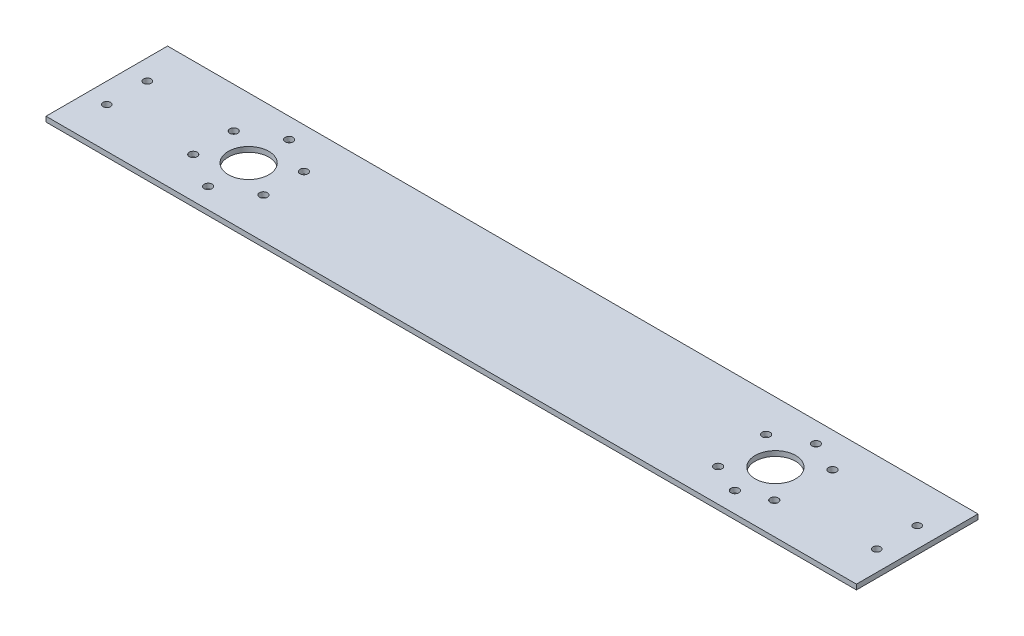
ISO-10303-21;
HEADER;
FILE_DESCRIPTION(('STEP AP214'),'2;1');
FILE_NAME('part.step','',(''),(''),'','','');
FILE_SCHEMA(('AUTOMOTIVE_DESIGN { 1 0 10303 214 1 1 1 1 }'));
ENDSEC;
DATA;
#1=APPLICATION_CONTEXT('core data for automotive mechanical design processes');
#2=APPLICATION_PROTOCOL_DEFINITION('international standard','automotive_design',2000,#1);
#3=PRODUCT_CONTEXT('',#1,'mechanical');
#4=PRODUCT('Part','Part','',(#3));
#5=PRODUCT_RELATED_PRODUCT_CATEGORY('part','',(#4));
#6=PRODUCT_DEFINITION_FORMATION('','',#4);
#7=PRODUCT_DEFINITION_CONTEXT('part definition',#1,'design');
#8=PRODUCT_DEFINITION('design','',#6,#7);
#9=PRODUCT_DEFINITION_SHAPE('','',#8);
#10=(LENGTH_UNIT() NAMED_UNIT(*) SI_UNIT(.MILLI.,.METRE.));
#11=(NAMED_UNIT(*) PLANE_ANGLE_UNIT() SI_UNIT($,.RADIAN.));
#12=(NAMED_UNIT(*) SI_UNIT($,.STERADIAN.) SOLID_ANGLE_UNIT());
#13=UNCERTAINTY_MEASURE_WITH_UNIT(LENGTH_MEASURE(1.E-05),#10,'distance_accuracy_value','');
#14=(GEOMETRIC_REPRESENTATION_CONTEXT(3) GLOBAL_UNCERTAINTY_ASSIGNED_CONTEXT((#13)) GLOBAL_UNIT_ASSIGNED_CONTEXT((#10,
#11,#12)) REPRESENTATION_CONTEXT('',''));
#15=CARTESIAN_POINT('',(0.,0.,0.));
#16=DIRECTION('',(0.,0.,1.));
#17=DIRECTION('',(1.,0.,0.));
#18=AXIS2_PLACEMENT_3D('',#15,#16,#17);
#19=CARTESIAN_POINT('',(-254.,3.175,38.1));
#20=DIRECTION('',(1.,0.,0.));
#21=DIRECTION('',(0.,0.,-1.));
#22=AXIS2_PLACEMENT_3D('',#19,#20,#21);
#23=PLANE('',#22);
#24=DIRECTION('',(0.,0.,1.));
#25=VECTOR('',#24,1.);
#26=CARTESIAN_POINT('',(-254.,0.,38.1));
#27=LINE('',#26,#25);
#28=CARTESIAN_POINT('',(-254.,0.,-38.1));
#29=VERTEX_POINT('',#28);
#30=CARTESIAN_POINT('',(-254.,0.,38.1));
#31=VERTEX_POINT('',#30);
#32=EDGE_CURVE('E96',#29,#31,#27,.T.);
#33=ORIENTED_EDGE('',*,*,#32,.T.);
#34=DIRECTION('',(0.,-1.,0.));
#35=VECTOR('',#34,1.);
#36=CARTESIAN_POINT('',(-254.,3.175,38.1));
#37=LINE('',#36,#35);
#38=CARTESIAN_POINT('',(-254.,3.175,38.1));
#39=VERTEX_POINT('',#38);
#40=EDGE_CURVE('E11',#39,#31,#37,.T.);
#41=ORIENTED_EDGE('',*,*,#40,.F.);
#42=DIRECTION('',(0.,0.,1.));
#43=VECTOR('',#42,1.);
#44=CARTESIAN_POINT('',(-254.,3.175,38.1));
#45=LINE('',#44,#43);
#46=CARTESIAN_POINT('',(-254.,3.175,-38.1));
#47=VERTEX_POINT('',#46);
#48=EDGE_CURVE('E84',#47,#39,#45,.T.);
#49=ORIENTED_EDGE('',*,*,#48,.F.);
#50=DIRECTION('',(0.,-1.,0.));
#51=VECTOR('',#50,1.);
#52=CARTESIAN_POINT('',(-254.,3.175,-38.1));
#53=LINE('',#52,#51);
#54=EDGE_CURVE('E92',#47,#29,#53,.T.);
#55=ORIENTED_EDGE('',*,*,#54,.T.);
#56=EDGE_LOOP('',(#33,#41,#49,#55));
#57=FACE_BOUND('',#56,.T.);
#58=ADVANCED_FACE('F33',(#57),#23,.F.);
#59=CARTESIAN_POINT('',(254.,3.175,38.1));
#60=DIRECTION('',(0.,0.,-1.));
#61=DIRECTION('',(-1.,0.,0.));
#62=AXIS2_PLACEMENT_3D('',#59,#60,#61);
#63=PLANE('',#62);
#64=DIRECTION('',(1.,0.,0.));
#65=VECTOR('',#64,1.);
#66=CARTESIAN_POINT('',(254.,0.,38.1));
#67=LINE('',#66,#65);
#68=CARTESIAN_POINT('',(254.,0.,38.1));
#69=VERTEX_POINT('',#68);
#70=EDGE_CURVE('E88',#31,#69,#67,.T.);
#71=ORIENTED_EDGE('',*,*,#70,.T.);
#72=DIRECTION('',(0.,-1.,0.));
#73=VECTOR('',#72,1.);
#74=CARTESIAN_POINT('',(254.,3.175,38.1));
#75=LINE('',#74,#73);
#76=CARTESIAN_POINT('',(254.,3.175,38.1));
#77=VERTEX_POINT('',#76);
#78=EDGE_CURVE('E41',#77,#69,#75,.T.);
#79=ORIENTED_EDGE('',*,*,#78,.F.);
#80=DIRECTION('',(1.,0.,0.));
#81=VECTOR('',#80,1.);
#82=CARTESIAN_POINT('',(254.,3.175,38.1));
#83=LINE('',#82,#81);
#84=EDGE_CURVE('E79',#39,#77,#83,.T.);
#85=ORIENTED_EDGE('',*,*,#84,.F.);
#86=ORIENTED_EDGE('',*,*,#40,.T.);
#87=EDGE_LOOP('',(#71,#79,#85,#86));
#88=FACE_BOUND('',#87,.T.);
#89=ADVANCED_FACE('F87',(#88),#63,.F.);
#90=CARTESIAN_POINT('',(254.,3.175,38.1));
#91=DIRECTION('',(-1.,0.,0.));
#92=DIRECTION('',(0.,0.,1.));
#93=AXIS2_PLACEMENT_3D('',#90,#91,#92);
#94=PLANE('',#93);
#95=DIRECTION('',(0.,0.,-1.));
#96=VECTOR('',#95,1.);
#97=CARTESIAN_POINT('',(254.,0.,38.1));
#98=LINE('',#97,#96);
#99=CARTESIAN_POINT('',(254.,0.,-38.1));
#100=VERTEX_POINT('',#99);
#101=EDGE_CURVE('E66',#69,#100,#98,.T.);
#102=ORIENTED_EDGE('',*,*,#101,.T.);
#103=DIRECTION('',(0.,-1.,0.));
#104=VECTOR('',#103,1.);
#105=CARTESIAN_POINT('',(254.,3.175,-38.1));
#106=LINE('',#105,#104);
#107=CARTESIAN_POINT('',(254.,3.175,-38.1));
#108=VERTEX_POINT('',#107);
#109=EDGE_CURVE('E89',#108,#100,#106,.T.);
#110=ORIENTED_EDGE('',*,*,#109,.F.);
#111=DIRECTION('',(0.,0.,-1.));
#112=VECTOR('',#111,1.);
#113=CARTESIAN_POINT('',(254.,3.175,38.1));
#114=LINE('',#113,#112);
#115=EDGE_CURVE('E82',#77,#108,#114,.T.);
#116=ORIENTED_EDGE('',*,*,#115,.F.);
#117=ORIENTED_EDGE('',*,*,#78,.T.);
#118=EDGE_LOOP('',(#102,#110,#116,#117));
#119=FACE_BOUND('',#118,.T.);
#120=ADVANCED_FACE('F90',(#119),#94,.F.);
#121=CARTESIAN_POINT('',(254.,3.175,-38.1));
#122=DIRECTION('',(0.,0.,1.));
#123=DIRECTION('',(1.,0.,0.));
#124=AXIS2_PLACEMENT_3D('',#121,#122,#123);
#125=PLANE('',#124);
#126=DIRECTION('',(-1.,0.,0.));
#127=VECTOR('',#126,1.);
#128=CARTESIAN_POINT('',(254.,0.,-38.1));
#129=LINE('',#128,#127);
#130=EDGE_CURVE('E72',#100,#29,#129,.T.);
#131=ORIENTED_EDGE('',*,*,#130,.T.);
#132=ORIENTED_EDGE('',*,*,#54,.F.);
#133=DIRECTION('',(-1.,0.,0.));
#134=VECTOR('',#133,1.);
#135=CARTESIAN_POINT('',(254.,3.175,-38.1));
#136=LINE('',#135,#134);
#137=EDGE_CURVE('E49',#108,#47,#136,.T.);
#138=ORIENTED_EDGE('',*,*,#137,.F.);
#139=ORIENTED_EDGE('',*,*,#109,.T.);
#140=EDGE_LOOP('',(#131,#132,#138,#139));
#141=FACE_BOUND('',#140,.T.);
#142=ADVANCED_FACE('F104',(#141),#125,.F.);
#143=CARTESIAN_POINT('',(0.,3.175,0.));
#144=DIRECTION('',(0.,1.,0.));
#145=DIRECTION('',(0.,0.,1.));
#146=AXIS2_PLACEMENT_3D('',#143,#144,#145);
#147=PLANE('',#146);
#148=CARTESIAN_POINT('',(-143.102954743875,3.175,12.7000000000001));
#149=DIRECTION('',(0.,1.,0.));
#150=DIRECTION('',(0.,0.,1.));
#151=AXIS2_PLACEMENT_3D('',#148,#149,#150);
#152=CIRCLE('',#151,2.4892);
#153=CARTESIAN_POINT('',(-143.102954743875,3.175,15.1892000000001));
#154=VERTEX_POINT('',#153);
#155=EDGE_CURVE('E138',#154,#154,#152,.T.);
#156=ORIENTED_EDGE('',*,*,#155,.F.);
#157=EDGE_LOOP('',(#156));
#158=FACE_BOUND('',#157,.T.);
#159=CARTESIAN_POINT('',(-165.1,3.175,25.4));
#160=DIRECTION('',(0.,1.,0.));
#161=DIRECTION('',(0.,0.,1.));
#162=AXIS2_PLACEMENT_3D('',#159,#160,#161);
#163=CIRCLE('',#162,2.4892);
#164=CARTESIAN_POINT('',(-165.1,3.175,27.8892));
#165=VERTEX_POINT('',#164);
#166=EDGE_CURVE('E148',#165,#165,#163,.T.);
#167=ORIENTED_EDGE('',*,*,#166,.F.);
#168=EDGE_LOOP('',(#167));
#169=FACE_BOUND('',#168,.T.);
#170=CARTESIAN_POINT('',(-165.1,3.175,-25.4));
#171=DIRECTION('',(0.,1.,0.));
#172=DIRECTION('',(0.,0.,1.));
#173=AXIS2_PLACEMENT_3D('',#170,#171,#172);
#174=CIRCLE('',#173,2.4892);
#175=CARTESIAN_POINT('',(-165.1,3.175,-22.9108));
#176=VERTEX_POINT('',#175);
#177=EDGE_CURVE('E151',#176,#176,#174,.T.);
#178=ORIENTED_EDGE('',*,*,#177,.F.);
#179=EDGE_LOOP('',(#178));
#180=FACE_BOUND('',#179,.T.);
#181=CARTESIAN_POINT('',(184.428439169374,3.175,-16.4794247252687));
#182=DIRECTION('',(0.,1.,0.));
#183=DIRECTION('',(0.,0.,1.));
#184=AXIS2_PLACEMENT_3D('',#181,#182,#183);
#185=CIRCLE('',#184,2.4892);
#186=CARTESIAN_POINT('',(184.428439169374,3.175,-13.9902247252687));
#187=VERTEX_POINT('',#186);
#188=EDGE_CURVE('E154',#187,#187,#185,.T.);
#189=ORIENTED_EDGE('',*,*,#188,.F.);
#190=EDGE_LOOP('',(#189));
#191=FACE_BOUND('',#190,.T.);
#192=CARTESIAN_POINT('',(144.478364544665,3.175,-14.8293004267659));
#193=DIRECTION('',(0.,1.,0.));
#194=DIRECTION('',(0.,0.,1.));
#195=AXIS2_PLACEMENT_3D('',#192,#193,#194);
#196=CIRCLE('',#195,2.4892);
#197=CARTESIAN_POINT('',(144.478364544665,3.175,-12.3401004267659));
#198=VERTEX_POINT('',#197);
#199=EDGE_CURVE('E157',#198,#198,#196,.T.);
#200=ORIENTED_EDGE('',*,*,#199,.F.);
#201=EDGE_LOOP('',(#200));
#202=FACE_BOUND('',#201,.T.);
#203=CARTESIAN_POINT('',(146.781232196869,3.175,17.5949636593817));
#204=DIRECTION('',(0.,1.,0.));
#205=DIRECTION('',(0.,0.,1.));
#206=AXIS2_PLACEMENT_3D('',#203,#204,#205);
#207=CIRCLE('',#206,2.4892);
#208=CARTESIAN_POINT('',(146.781232196869,3.175,20.0841636593817));
#209=VERTEX_POINT('',#208);
#210=EDGE_CURVE('E160',#209,#209,#207,.T.);
#211=ORIENTED_EDGE('',*,*,#210,.F.);
#212=EDGE_LOOP('',(#211));
#213=FACE_BOUND('',#212,.T.);
#214=CARTESIAN_POINT('',(182.702284281571,3.175,18.311733617295));
#215=DIRECTION('',(0.,1.,0.));
#216=DIRECTION('',(0.,0.,1.));
#217=AXIS2_PLACEMENT_3D('',#214,#215,#216);
#218=CIRCLE('',#217,2.4892);
#219=CARTESIAN_POINT('',(182.702284281571,3.175,20.800933617295));
#220=VERTEX_POINT('',#219);
#221=EDGE_CURVE('E163',#220,#220,#218,.T.);
#222=ORIENTED_EDGE('',*,*,#221,.F.);
#223=EDGE_LOOP('',(#222));
#224=FACE_BOUND('',#223,.T.);
#225=CARTESIAN_POINT('',(165.1,3.175,25.4));
#226=DIRECTION('',(0.,1.,0.));
#227=DIRECTION('',(0.,0.,1.));
#228=AXIS2_PLACEMENT_3D('',#225,#226,#227);
#229=CIRCLE('',#228,2.4892);
#230=CARTESIAN_POINT('',(165.1,3.175,27.8892));
#231=VERTEX_POINT('',#230);
#232=EDGE_CURVE('E166',#231,#231,#229,.T.);
#233=ORIENTED_EDGE('',*,*,#232,.F.);
#234=EDGE_LOOP('',(#233));
#235=FACE_BOUND('',#234,.T.);
#236=CARTESIAN_POINT('',(-143.102954743875,3.175,-12.7000000000001));
#237=DIRECTION('',(0.,1.,0.));
#238=DIRECTION('',(0.,0.,1.));
#239=AXIS2_PLACEMENT_3D('',#236,#237,#238);
#240=CIRCLE('',#239,2.4892);
#241=CARTESIAN_POINT('',(-143.102954743875,3.175,-10.2108000000001));
#242=VERTEX_POINT('',#241);
#243=EDGE_CURVE('E169',#242,#242,#240,.T.);
#244=ORIENTED_EDGE('',*,*,#243,.F.);
#245=EDGE_LOOP('',(#244));
#246=FACE_BOUND('',#245,.T.);
#247=CARTESIAN_POINT('',(-187.097045256125,3.175,-12.7));
#248=DIRECTION('',(0.,1.,0.));
#249=DIRECTION('',(0.,0.,1.));
#250=AXIS2_PLACEMENT_3D('',#247,#248,#249);
#251=CIRCLE('',#250,2.4892);
#252=CARTESIAN_POINT('',(-187.097045256125,3.175,-10.2108));
#253=VERTEX_POINT('',#252);
#254=EDGE_CURVE('E172',#253,#253,#251,.T.);
#255=ORIENTED_EDGE('',*,*,#254,.F.);
#256=EDGE_LOOP('',(#255));
#257=FACE_BOUND('',#256,.T.);
#258=CARTESIAN_POINT('',(-187.097045256125,3.175,12.7));
#259=DIRECTION('',(0.,1.,0.));
#260=DIRECTION('',(0.,0.,1.));
#261=AXIS2_PLACEMENT_3D('',#258,#259,#260);
#262=CIRCLE('',#261,2.4892);
#263=CARTESIAN_POINT('',(-187.097045256125,3.175,15.1892));
#264=VERTEX_POINT('',#263);
#265=EDGE_CURVE('E175',#264,#264,#262,.T.);
#266=ORIENTED_EDGE('',*,*,#265,.F.);
#267=EDGE_LOOP('',(#266));
#268=FACE_BOUND('',#267,.T.);
#269=CARTESIAN_POINT('',(165.1,3.175,-25.4));
#270=DIRECTION('',(0.,1.,0.));
#271=DIRECTION('',(0.,0.,1.));
#272=AXIS2_PLACEMENT_3D('',#269,#270,#271);
#273=CIRCLE('',#272,2.4892);
#274=CARTESIAN_POINT('',(165.1,3.175,-22.9108));
#275=VERTEX_POINT('',#274);
#276=EDGE_CURVE('E178',#275,#275,#273,.T.);
#277=ORIENTED_EDGE('',*,*,#276,.F.);
#278=EDGE_LOOP('',(#277));
#279=FACE_BOUND('',#278,.T.);
#280=CARTESIAN_POINT('',(-165.1,3.175,0.));
#281=DIRECTION('',(0.,1.,0.));
#282=DIRECTION('',(0.,0.,1.));
#283=AXIS2_PLACEMENT_3D('',#280,#281,#282);
#284=CIRCLE('',#283,12.7);
#285=CARTESIAN_POINT('',(-165.1,3.175,12.7));
#286=VERTEX_POINT('',#285);
#287=EDGE_CURVE('E141',#286,#286,#284,.T.);
#288=ORIENTED_EDGE('',*,*,#287,.F.);
#289=EDGE_LOOP('',(#288));
#290=FACE_BOUND('',#289,.T.);
#291=CARTESIAN_POINT('',(165.1,3.175,0.));
#292=DIRECTION('',(0.,1.,0.));
#293=DIRECTION('',(0.,0.,-1.));
#294=AXIS2_PLACEMENT_3D('',#291,#292,#293);
#295=CIRCLE('',#294,12.7);
#296=CARTESIAN_POINT('',(165.1,3.175,-12.7));
#297=VERTEX_POINT('',#296);
#298=EDGE_CURVE('E134',#297,#297,#295,.T.);
#299=ORIENTED_EDGE('',*,*,#298,.F.);
#300=EDGE_LOOP('',(#299));
#301=FACE_BOUND('',#300,.T.);
#302=CARTESIAN_POINT('',(241.3,3.175,-12.7000000000001));
#303=DIRECTION('',(0.,1.,0.));
#304=DIRECTION('',(0.,0.,-1.));
#305=AXIS2_PLACEMENT_3D('',#302,#303,#304);
#306=CIRCLE('',#305,2.38125000000001);
#307=CARTESIAN_POINT('',(241.3,3.175,-15.0812500000001));
#308=VERTEX_POINT('',#307);
#309=EDGE_CURVE('E116',#308,#308,#306,.T.);
#310=ORIENTED_EDGE('',*,*,#309,.F.);
#311=EDGE_LOOP('',(#310));
#312=FACE_BOUND('',#311,.T.);
#313=CARTESIAN_POINT('',(241.3,3.175,12.7));
#314=DIRECTION('',(0.,1.,0.));
#315=DIRECTION('',(0.,0.,-1.));
#316=AXIS2_PLACEMENT_3D('',#313,#314,#315);
#317=CIRCLE('',#316,2.38125000000001);
#318=CARTESIAN_POINT('',(241.3,3.175,10.31875));
#319=VERTEX_POINT('',#318);
#320=EDGE_CURVE('E123',#319,#319,#317,.T.);
#321=ORIENTED_EDGE('',*,*,#320,.F.);
#322=EDGE_LOOP('',(#321));
#323=FACE_BOUND('',#322,.T.);
#324=CARTESIAN_POINT('',(-241.3,3.175,12.7));
#325=DIRECTION('',(0.,1.,0.));
#326=DIRECTION('',(0.,0.,1.));
#327=AXIS2_PLACEMENT_3D('',#324,#325,#326);
#328=CIRCLE('',#327,2.38125000000001);
#329=CARTESIAN_POINT('',(-241.3,3.175,15.08125));
#330=VERTEX_POINT('',#329);
#331=EDGE_CURVE('E129',#330,#330,#328,.T.);
#332=ORIENTED_EDGE('',*,*,#331,.F.);
#333=EDGE_LOOP('',(#332));
#334=FACE_BOUND('',#333,.T.);
#335=CARTESIAN_POINT('',(-241.3,3.175,-12.7));
#336=DIRECTION('',(0.,1.,0.));
#337=DIRECTION('',(0.,0.,1.));
#338=AXIS2_PLACEMENT_3D('',#335,#336,#337);
#339=CIRCLE('',#338,2.38125000000001);
#340=CARTESIAN_POINT('',(-241.3,3.175,-10.31875));
#341=VERTEX_POINT('',#340);
#342=EDGE_CURVE('E110',#341,#341,#339,.T.);
#343=ORIENTED_EDGE('',*,*,#342,.F.);
#344=EDGE_LOOP('',(#343));
#345=FACE_BOUND('',#344,.T.);
#346=ORIENTED_EDGE('',*,*,#48,.T.);
#347=ORIENTED_EDGE('',*,*,#84,.T.);
#348=ORIENTED_EDGE('',*,*,#115,.T.);
#349=ORIENTED_EDGE('',*,*,#137,.T.);
#350=EDGE_LOOP('',(#346,#347,#348,#349));
#351=FACE_BOUND('',#350,.T.);
#352=ADVANCED_FACE('F80',(#158,#169,#180,#191,#202,#213,#224,#235,#246,#257,#268,#279,#290,#301,
#312,#323,#334,#345,#351),#147,.T.);
#353=CARTESIAN_POINT('',(0.,0.,0.));
#354=DIRECTION('',(0.,1.,0.));
#355=DIRECTION('',(0.,0.,1.));
#356=AXIS2_PLACEMENT_3D('',#353,#354,#355);
#357=PLANE('',#356);
#358=CARTESIAN_POINT('',(-143.102954743875,0.,12.7000000000001));
#359=DIRECTION('',(0.,1.,0.));
#360=DIRECTION('',(0.,0.,1.));
#361=AXIS2_PLACEMENT_3D('',#358,#359,#360);
#362=CIRCLE('',#361,2.4892);
#363=CARTESIAN_POINT('',(-143.102954743875,0.,15.1892000000001));
#364=VERTEX_POINT('',#363);
#365=EDGE_CURVE('E197',#364,#364,#362,.T.);
#366=ORIENTED_EDGE('',*,*,#365,.T.);
#367=EDGE_LOOP('',(#366));
#368=FACE_BOUND('',#367,.T.);
#369=CARTESIAN_POINT('',(-165.1,0.,25.4));
#370=DIRECTION('',(0.,1.,0.));
#371=DIRECTION('',(0.,0.,1.));
#372=AXIS2_PLACEMENT_3D('',#369,#370,#371);
#373=CIRCLE('',#372,2.4892);
#374=CARTESIAN_POINT('',(-165.1,0.,27.8892));
#375=VERTEX_POINT('',#374);
#376=EDGE_CURVE('E200',#375,#375,#373,.T.);
#377=ORIENTED_EDGE('',*,*,#376,.T.);
#378=EDGE_LOOP('',(#377));
#379=FACE_BOUND('',#378,.T.);
#380=CARTESIAN_POINT('',(-165.1,0.,-25.4));
#381=DIRECTION('',(0.,1.,0.));
#382=DIRECTION('',(0.,0.,1.));
#383=AXIS2_PLACEMENT_3D('',#380,#381,#382);
#384=CIRCLE('',#383,2.4892);
#385=CARTESIAN_POINT('',(-165.1,0.,-22.9108));
#386=VERTEX_POINT('',#385);
#387=EDGE_CURVE('E204',#386,#386,#384,.T.);
#388=ORIENTED_EDGE('',*,*,#387,.T.);
#389=EDGE_LOOP('',(#388));
#390=FACE_BOUND('',#389,.T.);
#391=CARTESIAN_POINT('',(184.428439169374,0.,-16.4794247252687));
#392=DIRECTION('',(0.,1.,0.));
#393=DIRECTION('',(0.,0.,1.));
#394=AXIS2_PLACEMENT_3D('',#391,#392,#393);
#395=CIRCLE('',#394,2.4892);
#396=CARTESIAN_POINT('',(184.428439169374,0.,-13.9902247252687));
#397=VERTEX_POINT('',#396);
#398=EDGE_CURVE('E189',#397,#397,#395,.T.);
#399=ORIENTED_EDGE('',*,*,#398,.T.);
#400=EDGE_LOOP('',(#399));
#401=FACE_BOUND('',#400,.T.);
#402=CARTESIAN_POINT('',(144.478364544665,0.,-14.8293004267659));
#403=DIRECTION('',(0.,1.,0.));
#404=DIRECTION('',(0.,0.,1.));
#405=AXIS2_PLACEMENT_3D('',#402,#403,#404);
#406=CIRCLE('',#405,2.4892);
#407=CARTESIAN_POINT('',(144.478364544665,0.,-12.3401004267659));
#408=VERTEX_POINT('',#407);
#409=EDGE_CURVE('E185',#408,#408,#406,.T.);
#410=ORIENTED_EDGE('',*,*,#409,.T.);
#411=EDGE_LOOP('',(#410));
#412=FACE_BOUND('',#411,.T.);
#413=CARTESIAN_POINT('',(146.781232196869,0.,17.5949636593817));
#414=DIRECTION('',(0.,1.,0.));
#415=DIRECTION('',(0.,0.,1.));
#416=AXIS2_PLACEMENT_3D('',#413,#414,#415);
#417=CIRCLE('',#416,2.4892);
#418=CARTESIAN_POINT('',(146.781232196869,0.,20.0841636593817));
#419=VERTEX_POINT('',#418);
#420=EDGE_CURVE('E188',#419,#419,#417,.T.);
#421=ORIENTED_EDGE('',*,*,#420,.T.);
#422=EDGE_LOOP('',(#421));
#423=FACE_BOUND('',#422,.T.);
#424=CARTESIAN_POINT('',(182.702284281571,0.,18.311733617295));
#425=DIRECTION('',(0.,1.,0.));
#426=DIRECTION('',(0.,0.,1.));
#427=AXIS2_PLACEMENT_3D('',#424,#425,#426);
#428=CIRCLE('',#427,2.4892);
#429=CARTESIAN_POINT('',(182.702284281571,0.,20.800933617295));
#430=VERTEX_POINT('',#429);
#431=EDGE_CURVE('E192',#430,#430,#428,.T.);
#432=ORIENTED_EDGE('',*,*,#431,.T.);
#433=EDGE_LOOP('',(#432));
#434=FACE_BOUND('',#433,.T.);
#435=CARTESIAN_POINT('',(165.1,0.,25.4));
#436=DIRECTION('',(0.,1.,0.));
#437=DIRECTION('',(0.,0.,1.));
#438=AXIS2_PLACEMENT_3D('',#435,#436,#437);
#439=CIRCLE('',#438,2.4892);
#440=CARTESIAN_POINT('',(165.1,0.,27.8892));
#441=VERTEX_POINT('',#440);
#442=EDGE_CURVE('E184',#441,#441,#439,.T.);
#443=ORIENTED_EDGE('',*,*,#442,.T.);
#444=EDGE_LOOP('',(#443));
#445=FACE_BOUND('',#444,.T.);
#446=CARTESIAN_POINT('',(-143.102954743875,0.,-12.7000000000001));
#447=DIRECTION('',(0.,1.,0.));
#448=DIRECTION('',(0.,0.,1.));
#449=AXIS2_PLACEMENT_3D('',#446,#447,#448);
#450=CIRCLE('',#449,2.4892);
#451=CARTESIAN_POINT('',(-143.102954743875,0.,-10.2108000000001));
#452=VERTEX_POINT('',#451);
#453=EDGE_CURVE('E201',#452,#452,#450,.T.);
#454=ORIENTED_EDGE('',*,*,#453,.T.);
#455=EDGE_LOOP('',(#454));
#456=FACE_BOUND('',#455,.T.);
#457=CARTESIAN_POINT('',(-187.097045256125,0.,-12.7));
#458=DIRECTION('',(0.,1.,0.));
#459=DIRECTION('',(0.,0.,1.));
#460=AXIS2_PLACEMENT_3D('',#457,#458,#459);
#461=CIRCLE('',#460,2.4892);
#462=CARTESIAN_POINT('',(-187.097045256125,0.,-10.2108));
#463=VERTEX_POINT('',#462);
#464=EDGE_CURVE('E212',#463,#463,#461,.T.);
#465=ORIENTED_EDGE('',*,*,#464,.T.);
#466=EDGE_LOOP('',(#465));
#467=FACE_BOUND('',#466,.T.);
#468=CARTESIAN_POINT('',(-187.097045256125,0.,12.7));
#469=DIRECTION('',(0.,1.,0.));
#470=DIRECTION('',(0.,0.,1.));
#471=AXIS2_PLACEMENT_3D('',#468,#469,#470);
#472=CIRCLE('',#471,2.4892);
#473=CARTESIAN_POINT('',(-187.097045256125,0.,15.1892));
#474=VERTEX_POINT('',#473);
#475=EDGE_CURVE('E209',#474,#474,#472,.T.);
#476=ORIENTED_EDGE('',*,*,#475,.T.);
#477=EDGE_LOOP('',(#476));
#478=FACE_BOUND('',#477,.T.);
#479=CARTESIAN_POINT('',(165.1,0.,-25.4));
#480=DIRECTION('',(0.,1.,0.));
#481=DIRECTION('',(0.,0.,1.));
#482=AXIS2_PLACEMENT_3D('',#479,#480,#481);
#483=CIRCLE('',#482,2.4892);
#484=CARTESIAN_POINT('',(165.1,0.,-22.9108));
#485=VERTEX_POINT('',#484);
#486=EDGE_CURVE('E181',#485,#485,#483,.T.);
#487=ORIENTED_EDGE('',*,*,#486,.T.);
#488=EDGE_LOOP('',(#487));
#489=FACE_BOUND('',#488,.T.);
#490=CARTESIAN_POINT('',(-165.1,0.,0.));
#491=DIRECTION('',(0.,1.,0.));
#492=DIRECTION('',(0.,0.,1.));
#493=AXIS2_PLACEMENT_3D('',#490,#491,#492);
#494=CIRCLE('',#493,12.7);
#495=CARTESIAN_POINT('',(-165.1,0.,12.7));
#496=VERTEX_POINT('',#495);
#497=EDGE_CURVE('E120',#496,#496,#494,.T.);
#498=ORIENTED_EDGE('',*,*,#497,.T.);
#499=EDGE_LOOP('',(#498));
#500=FACE_BOUND('',#499,.T.);
#501=CARTESIAN_POINT('',(165.1,0.,0.));
#502=DIRECTION('',(0.,1.,0.));
#503=DIRECTION('',(0.,0.,-1.));
#504=AXIS2_PLACEMENT_3D('',#501,#502,#503);
#505=CIRCLE('',#504,12.7);
#506=CARTESIAN_POINT('',(165.1,0.,-12.7));
#507=VERTEX_POINT('',#506);
#508=EDGE_CURVE('E137',#507,#507,#505,.T.);
#509=ORIENTED_EDGE('',*,*,#508,.T.);
#510=EDGE_LOOP('',(#509));
#511=FACE_BOUND('',#510,.T.);
#512=CARTESIAN_POINT('',(241.3,0.,-12.7000000000001));
#513=DIRECTION('',(0.,1.,0.));
#514=DIRECTION('',(0.,0.,-1.));
#515=AXIS2_PLACEMENT_3D('',#512,#513,#514);
#516=CIRCLE('',#515,2.38125000000001);
#517=CARTESIAN_POINT('',(241.3,0.,-15.0812500000001));
#518=VERTEX_POINT('',#517);
#519=EDGE_CURVE('E119',#518,#518,#516,.T.);
#520=ORIENTED_EDGE('',*,*,#519,.T.);
#521=EDGE_LOOP('',(#520));
#522=FACE_BOUND('',#521,.T.);
#523=CARTESIAN_POINT('',(241.3,0.,12.7));
#524=DIRECTION('',(0.,1.,0.));
#525=DIRECTION('',(0.,0.,-1.));
#526=AXIS2_PLACEMENT_3D('',#523,#524,#525);
#527=CIRCLE('',#526,2.38125000000001);
#528=CARTESIAN_POINT('',(241.3,0.,10.31875));
#529=VERTEX_POINT('',#528);
#530=EDGE_CURVE('E126',#529,#529,#527,.T.);
#531=ORIENTED_EDGE('',*,*,#530,.T.);
#532=EDGE_LOOP('',(#531));
#533=FACE_BOUND('',#532,.T.);
#534=CARTESIAN_POINT('',(-241.3,0.,12.7));
#535=DIRECTION('',(0.,1.,0.));
#536=DIRECTION('',(0.,0.,1.));
#537=AXIS2_PLACEMENT_3D('',#534,#535,#536);
#538=CIRCLE('',#537,2.38125000000001);
#539=CARTESIAN_POINT('',(-241.3,0.,15.08125));
#540=VERTEX_POINT('',#539);
#541=EDGE_CURVE('E113',#540,#540,#538,.T.);
#542=ORIENTED_EDGE('',*,*,#541,.T.);
#543=EDGE_LOOP('',(#542));
#544=FACE_BOUND('',#543,.T.);
#545=CARTESIAN_POINT('',(-241.3,0.,-12.7));
#546=DIRECTION('',(0.,1.,0.));
#547=DIRECTION('',(0.,0.,1.));
#548=AXIS2_PLACEMENT_3D('',#545,#546,#547);
#549=CIRCLE('',#548,2.38125000000001);
#550=CARTESIAN_POINT('',(-241.3,0.,-10.31875));
#551=VERTEX_POINT('',#550);
#552=EDGE_CURVE('E99',#551,#551,#549,.T.);
#553=ORIENTED_EDGE('',*,*,#552,.T.);
#554=EDGE_LOOP('',(#553));
#555=FACE_BOUND('',#554,.T.);
#556=ORIENTED_EDGE('',*,*,#32,.F.);
#557=ORIENTED_EDGE('',*,*,#130,.F.);
#558=ORIENTED_EDGE('',*,*,#101,.F.);
#559=ORIENTED_EDGE('',*,*,#70,.F.);
#560=EDGE_LOOP('',(#556,#557,#558,#559));
#561=FACE_BOUND('',#560,.T.);
#562=ADVANCED_FACE('F107',(#368,#379,#390,#401,#412,#423,#434,#445,#456,#467,#478,#489,#500,
#511,#522,#533,#544,#555,#561),#357,.F.);
#563=CARTESIAN_POINT('',(-241.3,0.,-12.7));
#564=DIRECTION('',(0.,1.,0.));
#565=DIRECTION('',(0.,0.,1.));
#566=AXIS2_PLACEMENT_3D('',#563,#564,#565);
#567=CYLINDRICAL_SURFACE('',#566,2.38125000000001);
#568=ORIENTED_EDGE('',*,*,#552,.F.);
#569=EDGE_LOOP('',(#568));
#570=FACE_BOUND('',#569,.T.);
#571=ORIENTED_EDGE('',*,*,#342,.T.);
#572=EDGE_LOOP('',(#571));
#573=FACE_BOUND('',#572,.T.);
#574=ADVANCED_FACE('F249',(#570,#573),#567,.F.);
#575=CARTESIAN_POINT('',(-241.3,0.,12.7));
#576=DIRECTION('',(0.,1.,0.));
#577=DIRECTION('',(0.,0.,1.));
#578=AXIS2_PLACEMENT_3D('',#575,#576,#577);
#579=CYLINDRICAL_SURFACE('',#578,2.38125000000001);
#580=ORIENTED_EDGE('',*,*,#541,.F.);
#581=EDGE_LOOP('',(#580));
#582=FACE_BOUND('',#581,.T.);
#583=ORIENTED_EDGE('',*,*,#331,.T.);
#584=EDGE_LOOP('',(#583));
#585=FACE_BOUND('',#584,.T.);
#586=ADVANCED_FACE('F256',(#582,#585),#579,.F.);
#587=CARTESIAN_POINT('',(241.3,0.,12.7));
#588=DIRECTION('',(0.,1.,0.));
#589=DIRECTION('',(0.,0.,1.));
#590=AXIS2_PLACEMENT_3D('',#587,#588,#589);
#591=CYLINDRICAL_SURFACE('',#590,2.38125000000001);
#592=ORIENTED_EDGE('',*,*,#530,.F.);
#593=EDGE_LOOP('',(#592));
#594=FACE_BOUND('',#593,.T.);
#595=ORIENTED_EDGE('',*,*,#320,.T.);
#596=EDGE_LOOP('',(#595));
#597=FACE_BOUND('',#596,.T.);
#598=ADVANCED_FACE('F262',(#594,#597),#591,.F.);
#599=CARTESIAN_POINT('',(241.3,0.,-12.7000000000001));
#600=DIRECTION('',(0.,1.,0.));
#601=DIRECTION('',(0.,0.,1.));
#602=AXIS2_PLACEMENT_3D('',#599,#600,#601);
#603=CYLINDRICAL_SURFACE('',#602,2.38125000000001);
#604=ORIENTED_EDGE('',*,*,#519,.F.);
#605=EDGE_LOOP('',(#604));
#606=FACE_BOUND('',#605,.T.);
#607=ORIENTED_EDGE('',*,*,#309,.T.);
#608=EDGE_LOOP('',(#607));
#609=FACE_BOUND('',#608,.T.);
#610=ADVANCED_FACE('F258',(#606,#609),#603,.F.);
#611=CARTESIAN_POINT('',(165.1,0.,0.));
#612=DIRECTION('',(0.,1.,0.));
#613=DIRECTION('',(0.,0.,1.));
#614=AXIS2_PLACEMENT_3D('',#611,#612,#613);
#615=CYLINDRICAL_SURFACE('',#614,12.7);
#616=ORIENTED_EDGE('',*,*,#508,.F.);
#617=EDGE_LOOP('',(#616));
#618=FACE_BOUND('',#617,.T.);
#619=ORIENTED_EDGE('',*,*,#298,.T.);
#620=EDGE_LOOP('',(#619));
#621=FACE_BOUND('',#620,.T.);
#622=ADVANCED_FACE('F261',(#618,#621),#615,.F.);
#623=CARTESIAN_POINT('',(-165.1,0.,0.));
#624=DIRECTION('',(0.,1.,0.));
#625=DIRECTION('',(0.,0.,1.));
#626=AXIS2_PLACEMENT_3D('',#623,#624,#625);
#627=CYLINDRICAL_SURFACE('',#626,12.7);
#628=ORIENTED_EDGE('',*,*,#497,.F.);
#629=EDGE_LOOP('',(#628));
#630=FACE_BOUND('',#629,.T.);
#631=ORIENTED_EDGE('',*,*,#287,.T.);
#632=EDGE_LOOP('',(#631));
#633=FACE_BOUND('',#632,.T.);
#634=ADVANCED_FACE('F272',(#630,#633),#627,.F.);
#635=CARTESIAN_POINT('',(165.1,0.,-25.4));
#636=DIRECTION('',(0.,1.,0.));
#637=DIRECTION('',(0.,0.,1.));
#638=AXIS2_PLACEMENT_3D('',#635,#636,#637);
#639=CYLINDRICAL_SURFACE('',#638,2.4892);
#640=ORIENTED_EDGE('',*,*,#276,.T.);
#641=EDGE_LOOP('',(#640));
#642=FACE_BOUND('',#641,.T.);
#643=ORIENTED_EDGE('',*,*,#486,.F.);
#644=EDGE_LOOP('',(#643));
#645=FACE_BOUND('',#644,.T.);
#646=ADVANCED_FACE('F276',(#642,#645),#639,.F.);
#647=CARTESIAN_POINT('',(-187.097045256125,0.,12.7));
#648=DIRECTION('',(0.,1.,0.));
#649=DIRECTION('',(0.,0.,1.));
#650=AXIS2_PLACEMENT_3D('',#647,#648,#649);
#651=CYLINDRICAL_SURFACE('',#650,2.4892);
#652=ORIENTED_EDGE('',*,*,#265,.T.);
#653=EDGE_LOOP('',(#652));
#654=FACE_BOUND('',#653,.T.);
#655=ORIENTED_EDGE('',*,*,#475,.F.);
#656=EDGE_LOOP('',(#655));
#657=FACE_BOUND('',#656,.T.);
#658=ADVANCED_FACE('F233',(#654,#657),#651,.F.);
#659=CARTESIAN_POINT('',(-187.097045256125,0.,-12.7));
#660=DIRECTION('',(0.,1.,0.));
#661=DIRECTION('',(0.,0.,1.));
#662=AXIS2_PLACEMENT_3D('',#659,#660,#661);
#663=CYLINDRICAL_SURFACE('',#662,2.4892);
#664=ORIENTED_EDGE('',*,*,#254,.T.);
#665=EDGE_LOOP('',(#664));
#666=FACE_BOUND('',#665,.T.);
#667=ORIENTED_EDGE('',*,*,#464,.F.);
#668=EDGE_LOOP('',(#667));
#669=FACE_BOUND('',#668,.T.);
#670=ADVANCED_FACE('F223',(#666,#669),#663,.F.);
#671=CARTESIAN_POINT('',(-143.102954743875,0.,-12.7000000000001));
#672=DIRECTION('',(0.,1.,0.));
#673=DIRECTION('',(0.,0.,1.));
#674=AXIS2_PLACEMENT_3D('',#671,#672,#673);
#675=CYLINDRICAL_SURFACE('',#674,2.4892);
#676=ORIENTED_EDGE('',*,*,#243,.T.);
#677=EDGE_LOOP('',(#676));
#678=FACE_BOUND('',#677,.T.);
#679=ORIENTED_EDGE('',*,*,#453,.F.);
#680=EDGE_LOOP('',(#679));
#681=FACE_BOUND('',#680,.T.);
#682=ADVANCED_FACE('F220',(#678,#681),#675,.F.);
#683=CARTESIAN_POINT('',(165.1,0.,25.4));
#684=DIRECTION('',(0.,1.,0.));
#685=DIRECTION('',(0.,0.,1.));
#686=AXIS2_PLACEMENT_3D('',#683,#684,#685);
#687=CYLINDRICAL_SURFACE('',#686,2.4892);
#688=ORIENTED_EDGE('',*,*,#232,.T.);
#689=EDGE_LOOP('',(#688));
#690=FACE_BOUND('',#689,.T.);
#691=ORIENTED_EDGE('',*,*,#442,.F.);
#692=EDGE_LOOP('',(#691));
#693=FACE_BOUND('',#692,.T.);
#694=ADVANCED_FACE('F222',(#690,#693),#687,.F.);
#695=CARTESIAN_POINT('',(182.702284281571,0.,18.311733617295));
#696=DIRECTION('',(0.,1.,0.));
#697=DIRECTION('',(0.,0.,1.));
#698=AXIS2_PLACEMENT_3D('',#695,#696,#697);
#699=CYLINDRICAL_SURFACE('',#698,2.4892);
#700=ORIENTED_EDGE('',*,*,#221,.T.);
#701=EDGE_LOOP('',(#700));
#702=FACE_BOUND('',#701,.T.);
#703=ORIENTED_EDGE('',*,*,#431,.F.);
#704=EDGE_LOOP('',(#703));
#705=FACE_BOUND('',#704,.T.);
#706=ADVANCED_FACE('F230',(#702,#705),#699,.F.);
#707=CARTESIAN_POINT('',(146.781232196869,0.,17.5949636593817));
#708=DIRECTION('',(0.,1.,0.));
#709=DIRECTION('',(0.,0.,1.));
#710=AXIS2_PLACEMENT_3D('',#707,#708,#709);
#711=CYLINDRICAL_SURFACE('',#710,2.4892);
#712=ORIENTED_EDGE('',*,*,#210,.T.);
#713=EDGE_LOOP('',(#712));
#714=FACE_BOUND('',#713,.T.);
#715=ORIENTED_EDGE('',*,*,#420,.F.);
#716=EDGE_LOOP('',(#715));
#717=FACE_BOUND('',#716,.T.);
#718=ADVANCED_FACE('F285',(#714,#717),#711,.F.);
#719=CARTESIAN_POINT('',(144.478364544665,0.,-14.8293004267659));
#720=DIRECTION('',(0.,1.,0.));
#721=DIRECTION('',(0.,0.,1.));
#722=AXIS2_PLACEMENT_3D('',#719,#720,#721);
#723=CYLINDRICAL_SURFACE('',#722,2.4892);
#724=ORIENTED_EDGE('',*,*,#199,.T.);
#725=EDGE_LOOP('',(#724));
#726=FACE_BOUND('',#725,.T.);
#727=ORIENTED_EDGE('',*,*,#409,.F.);
#728=EDGE_LOOP('',(#727));
#729=FACE_BOUND('',#728,.T.);
#730=ADVANCED_FACE('F281',(#726,#729),#723,.F.);
#731=CARTESIAN_POINT('',(184.428439169374,0.,-16.4794247252687));
#732=DIRECTION('',(0.,1.,0.));
#733=DIRECTION('',(0.,0.,1.));
#734=AXIS2_PLACEMENT_3D('',#731,#732,#733);
#735=CYLINDRICAL_SURFACE('',#734,2.4892);
#736=ORIENTED_EDGE('',*,*,#188,.T.);
#737=EDGE_LOOP('',(#736));
#738=FACE_BOUND('',#737,.T.);
#739=ORIENTED_EDGE('',*,*,#398,.F.);
#740=EDGE_LOOP('',(#739));
#741=FACE_BOUND('',#740,.T.);
#742=ADVANCED_FACE('F284',(#738,#741),#735,.F.);
#743=CARTESIAN_POINT('',(-165.1,0.,-25.4));
#744=DIRECTION('',(0.,1.,0.));
#745=DIRECTION('',(0.,0.,1.));
#746=AXIS2_PLACEMENT_3D('',#743,#744,#745);
#747=CYLINDRICAL_SURFACE('',#746,2.4892);
#748=ORIENTED_EDGE('',*,*,#177,.T.);
#749=EDGE_LOOP('',(#748));
#750=FACE_BOUND('',#749,.T.);
#751=ORIENTED_EDGE('',*,*,#387,.F.);
#752=EDGE_LOOP('',(#751));
#753=FACE_BOUND('',#752,.T.);
#754=ADVANCED_FACE('F300',(#750,#753),#747,.F.);
#755=CARTESIAN_POINT('',(-165.1,0.,25.4));
#756=DIRECTION('',(0.,1.,0.));
#757=DIRECTION('',(0.,0.,1.));
#758=AXIS2_PLACEMENT_3D('',#755,#756,#757);
#759=CYLINDRICAL_SURFACE('',#758,2.4892);
#760=ORIENTED_EDGE('',*,*,#166,.T.);
#761=EDGE_LOOP('',(#760));
#762=FACE_BOUND('',#761,.T.);
#763=ORIENTED_EDGE('',*,*,#376,.F.);
#764=EDGE_LOOP('',(#763));
#765=FACE_BOUND('',#764,.T.);
#766=ADVANCED_FACE('F296',(#762,#765),#759,.F.);
#767=CARTESIAN_POINT('',(-143.102954743875,0.,12.7000000000001));
#768=DIRECTION('',(0.,1.,0.));
#769=DIRECTION('',(0.,0.,1.));
#770=AXIS2_PLACEMENT_3D('',#767,#768,#769);
#771=CYLINDRICAL_SURFACE('',#770,2.4892);
#772=ORIENTED_EDGE('',*,*,#155,.T.);
#773=EDGE_LOOP('',(#772));
#774=FACE_BOUND('',#773,.T.);
#775=ORIENTED_EDGE('',*,*,#365,.F.);
#776=EDGE_LOOP('',(#775));
#777=FACE_BOUND('',#776,.T.);
#778=ADVANCED_FACE('F293',(#774,#777),#771,.F.);
#779=CLOSED_SHELL('',(#58,#89,#120,#142,#352,#562,#574,#586,#598,#610,#622,#634,#646,#658,#670,
#682,#694,#706,#718,#730,#742,#754,#766,#778));
#780=MANIFOLD_SOLID_BREP('B2',#779);
#781=ADVANCED_BREP_SHAPE_REPRESENTATION('',(#18,#780),#14);
#782=SHAPE_DEFINITION_REPRESENTATION(#9,#781);
ENDSEC;
END-ISO-10303-21;
